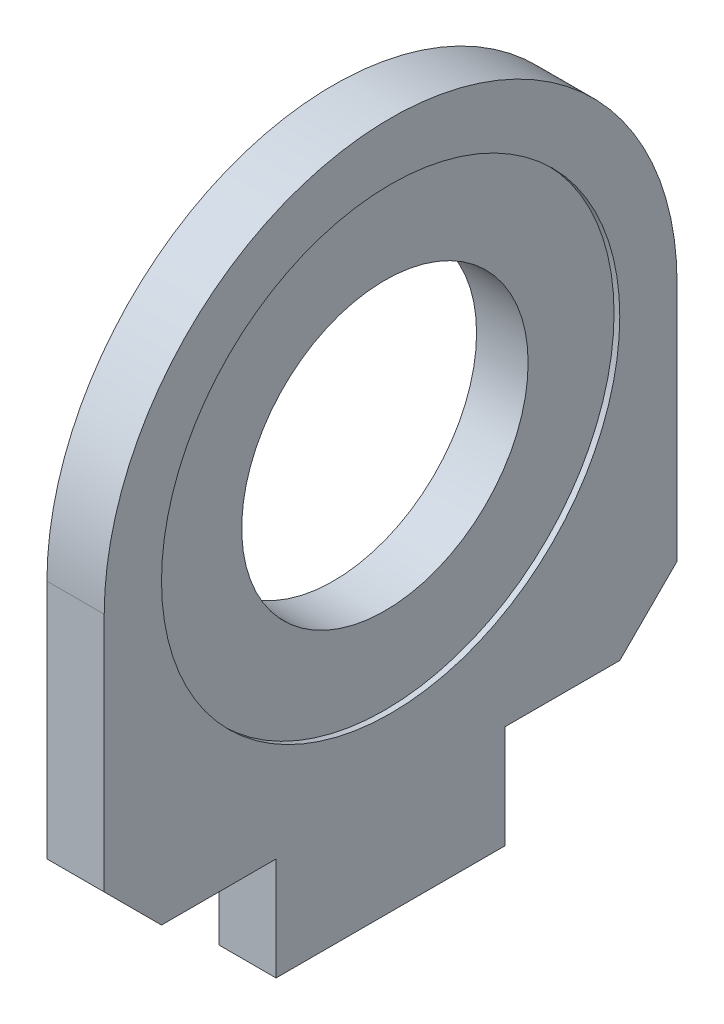
ISO-10303-21;
HEADER;
FILE_DESCRIPTION(('STEP AP214'),'2;1');
FILE_NAME('part.step','',(''),(''),'','','');
FILE_SCHEMA(('AUTOMOTIVE_DESIGN { 1 0 10303 214 1 1 1 1 }'));
ENDSEC;
DATA;
#1=APPLICATION_CONTEXT('core data for automotive mechanical design processes');
#2=APPLICATION_PROTOCOL_DEFINITION('international standard','automotive_design',2000,#1);
#3=PRODUCT_CONTEXT('',#1,'mechanical');
#4=PRODUCT('Part','Part','',(#3));
#5=PRODUCT_RELATED_PRODUCT_CATEGORY('part','',(#4));
#6=PRODUCT_DEFINITION_FORMATION('','',#4);
#7=PRODUCT_DEFINITION_CONTEXT('part definition',#1,'design');
#8=PRODUCT_DEFINITION('design','',#6,#7);
#9=PRODUCT_DEFINITION_SHAPE('','',#8);
#10=(LENGTH_UNIT() NAMED_UNIT(*) SI_UNIT(.MILLI.,.METRE.));
#11=(NAMED_UNIT(*) PLANE_ANGLE_UNIT() SI_UNIT($,.RADIAN.));
#12=(NAMED_UNIT(*) SI_UNIT($,.STERADIAN.) SOLID_ANGLE_UNIT());
#13=UNCERTAINTY_MEASURE_WITH_UNIT(LENGTH_MEASURE(1.E-05),#10,'distance_accuracy_value','');
#14=(GEOMETRIC_REPRESENTATION_CONTEXT(3) GLOBAL_UNCERTAINTY_ASSIGNED_CONTEXT((#13)) GLOBAL_UNIT_ASSIGNED_CONTEXT((#10,
#11,#12)) REPRESENTATION_CONTEXT('',''));
#15=CARTESIAN_POINT('',(0.,0.,0.));
#16=DIRECTION('',(0.,0.,1.));
#17=DIRECTION('',(1.,0.,0.));
#18=AXIS2_PLACEMENT_3D('',#15,#16,#17);
#19=CARTESIAN_POINT('',(-1.,70.,0.));
#20=DIRECTION('',(1.,0.,0.));
#21=DIRECTION('',(0.,0.,-1.));
#22=AXIS2_PLACEMENT_3D('',#19,#20,#21);
#23=CYLINDRICAL_SURFACE('',#22,40.);
#24=CARTESIAN_POINT('',(0.,70.,0.));
#25=DIRECTION('',(1.,0.,0.));
#26=DIRECTION('',(0.,0.,-1.));
#27=AXIS2_PLACEMENT_3D('',#24,#25,#26);
#28=CIRCLE('',#27,40.);
#29=CARTESIAN_POINT('',(0.,70.,-40.));
#30=VERTEX_POINT('',#29);
#31=EDGE_CURVE('E21',#30,#30,#28,.T.);
#32=ORIENTED_EDGE('',*,*,#31,.T.);
#33=EDGE_LOOP('',(#32));
#34=FACE_BOUND('',#33,.T.);
#35=CARTESIAN_POINT('',(-1.,70.,0.));
#36=DIRECTION('',(1.,0.,0.));
#37=DIRECTION('',(0.,0.,-1.));
#38=AXIS2_PLACEMENT_3D('',#35,#36,#37);
#39=CIRCLE('',#38,40.);
#40=CARTESIAN_POINT('',(-1.,70.,-40.));
#41=VERTEX_POINT('',#40);
#42=EDGE_CURVE('E174',#41,#41,#39,.T.);
#43=ORIENTED_EDGE('',*,*,#42,.F.);
#44=EDGE_LOOP('',(#43));
#45=FACE_BOUND('',#44,.T.);
#46=ADVANCED_FACE('F18',(#34,#45),#23,.F.);
#47=CARTESIAN_POINT('',(0.,70.,0.));
#48=DIRECTION('',(-1.,0.,0.));
#49=DIRECTION('',(0.,0.,1.));
#50=AXIS2_PLACEMENT_3D('',#47,#48,#49);
#51=PLANE('',#50);
#52=DIRECTION('',(0.,-0.707106781186549,-0.707106781186546));
#53=VECTOR('',#52,1.);
#54=CARTESIAN_POINT('',(0.,18.,40.));
#55=LINE('',#54,#53);
#56=CARTESIAN_POINT('',(0.,18.,40.));
#57=VERTEX_POINT('',#56);
#58=CARTESIAN_POINT('',(0.,28.,50.));
#59=VERTEX_POINT('',#58);
#60=EDGE_CURVE('E152',#57,#59,#55,.F.);
#61=ORIENTED_EDGE('',*,*,#60,.F.);
#62=DIRECTION('',(0.,0.,1.));
#63=VECTOR('',#62,1.);
#64=CARTESIAN_POINT('',(0.,18.,20.));
#65=LINE('',#64,#63);
#66=CARTESIAN_POINT('',(0.,18.,20.));
#67=VERTEX_POINT('',#66);
#68=EDGE_CURVE('E172',#57,#67,#65,.F.);
#69=ORIENTED_EDGE('',*,*,#68,.T.);
#70=DIRECTION('',(0.,1.,0.));
#71=VECTOR('',#70,1.);
#72=CARTESIAN_POINT('',(0.,18.,20.));
#73=LINE('',#72,#71);
#74=CARTESIAN_POINT('',(0.,0.,20.));
#75=VERTEX_POINT('',#74);
#76=EDGE_CURVE('E163',#67,#75,#73,.F.);
#77=ORIENTED_EDGE('',*,*,#76,.T.);
#78=DIRECTION('',(0.,0.,-1.));
#79=VECTOR('',#78,1.);
#80=CARTESIAN_POINT('',(0.,0.,50.));
#81=LINE('',#80,#79);
#82=CARTESIAN_POINT('',(0.,0.,-20.));
#83=VERTEX_POINT('',#82);
#84=EDGE_CURVE('E164',#83,#75,#81,.F.);
#85=ORIENTED_EDGE('',*,*,#84,.F.);
#86=DIRECTION('',(0.,-1.,0.));
#87=VECTOR('',#86,1.);
#88=CARTESIAN_POINT('',(0.,18.,-20.));
#89=LINE('',#88,#87);
#90=CARTESIAN_POINT('',(0.,18.,-20.));
#91=VERTEX_POINT('',#90);
#92=EDGE_CURVE('E124',#83,#91,#89,.F.);
#93=ORIENTED_EDGE('',*,*,#92,.T.);
#94=DIRECTION('',(0.,0.,1.));
#95=VECTOR('',#94,1.);
#96=CARTESIAN_POINT('',(0.,18.,-20.));
#97=LINE('',#96,#95);
#98=CARTESIAN_POINT('',(0.,18.,-40.));
#99=VERTEX_POINT('',#98);
#100=EDGE_CURVE('E133',#91,#99,#97,.F.);
#101=ORIENTED_EDGE('',*,*,#100,.T.);
#102=DIRECTION('',(0.,0.707106781186546,-0.707106781186549));
#103=VECTOR('',#102,1.);
#104=CARTESIAN_POINT('',(0.,28.,-50.));
#105=LINE('',#104,#103);
#106=CARTESIAN_POINT('',(0.,28.,-50.));
#107=VERTEX_POINT('',#106);
#108=EDGE_CURVE('E101',#107,#99,#105,.F.);
#109=ORIENTED_EDGE('',*,*,#108,.F.);
#110=DIRECTION('',(0.,1.,0.));
#111=VECTOR('',#110,1.);
#112=CARTESIAN_POINT('',(0.,0.,-50.));
#113=LINE('',#112,#111);
#114=CARTESIAN_POINT('',(0.,70.,-50.));
#115=VERTEX_POINT('',#114);
#116=EDGE_CURVE('E97',#115,#107,#113,.F.);
#117=ORIENTED_EDGE('',*,*,#116,.F.);
#118=CARTESIAN_POINT('',(0.,70.,0.));
#119=DIRECTION('',(1.,0.,0.));
#120=DIRECTION('',(0.,0.,-1.));
#121=AXIS2_PLACEMENT_3D('',#118,#119,#120);
#122=CIRCLE('',#121,50.);
#123=CARTESIAN_POINT('',(0.,70.,50.));
#124=VERTEX_POINT('',#123);
#125=EDGE_CURVE('E94',#124,#115,#122,.F.);
#126=ORIENTED_EDGE('',*,*,#125,.F.);
#127=DIRECTION('',(0.,1.,0.));
#128=VECTOR('',#127,1.);
#129=CARTESIAN_POINT('',(0.,0.,50.));
#130=LINE('',#129,#128);
#131=EDGE_CURVE('E113',#59,#124,#130,.T.);
#132=ORIENTED_EDGE('',*,*,#131,.F.);
#133=EDGE_LOOP('',(#61,#69,#77,#85,#93,#101,#109,#117,#126,#132));
#134=FACE_BOUND('',#133,.T.);
#135=ORIENTED_EDGE('',*,*,#31,.F.);
#136=EDGE_LOOP('',(#135));
#137=FACE_BOUND('',#136,.T.);
#138=ADVANCED_FACE('F98',(#134,#137),#51,.F.);
#139=CARTESIAN_POINT('',(-1.,70.,0.));
#140=DIRECTION('',(1.,0.,0.));
#141=DIRECTION('',(0.,0.,-1.));
#142=AXIS2_PLACEMENT_3D('',#139,#140,#141);
#143=PLANE('',#142);
#144=CARTESIAN_POINT('',(-0.999999999999999,70.,0.));
#145=DIRECTION('',(1.,0.,0.));
#146=DIRECTION('',(0.,0.,-1.));
#147=AXIS2_PLACEMENT_3D('',#144,#145,#146);
#148=CIRCLE('',#147,25.);
#149=CARTESIAN_POINT('',(-0.999999999999999,70.,-25.));
#150=VERTEX_POINT('',#149);
#151=EDGE_CURVE('E157',#150,#150,#148,.F.);
#152=ORIENTED_EDGE('',*,*,#151,.T.);
#153=EDGE_LOOP('',(#152));
#154=FACE_BOUND('',#153,.T.);
#155=ORIENTED_EDGE('',*,*,#42,.T.);
#156=EDGE_LOOP('',(#155));
#157=FACE_BOUND('',#156,.T.);
#158=ADVANCED_FACE('F208',(#154,#157),#143,.T.);
#159=CARTESIAN_POINT('',(0.,18.,20.));
#160=DIRECTION('',(0.,1.,0.));
#161=DIRECTION('',(0.,0.,1.));
#162=AXIS2_PLACEMENT_3D('',#159,#160,#161);
#163=PLANE('',#162);
#164=DIRECTION('',(1.,0.,0.));
#165=VECTOR('',#164,1.);
#166=CARTESIAN_POINT('',(0.,18.,40.));
#167=LINE('',#166,#165);
#168=CARTESIAN_POINT('',(-10.,18.,40.));
#169=VERTEX_POINT('',#168);
#170=EDGE_CURVE('E140',#169,#57,#167,.T.);
#171=ORIENTED_EDGE('',*,*,#170,.F.);
#172=DIRECTION('',(0.,0.,1.));
#173=VECTOR('',#172,1.);
#174=CARTESIAN_POINT('',(-10.,18.,0.));
#175=LINE('',#174,#173);
#176=CARTESIAN_POINT('',(-10.,18.,20.));
#177=VERTEX_POINT('',#176);
#178=EDGE_CURVE('E147',#177,#169,#175,.T.);
#179=ORIENTED_EDGE('',*,*,#178,.F.);
#180=DIRECTION('',(1.,0.,0.));
#181=VECTOR('',#180,1.);
#182=CARTESIAN_POINT('',(0.,18.,20.));
#183=LINE('',#182,#181);
#184=EDGE_CURVE('E160',#177,#67,#183,.T.);
#185=ORIENTED_EDGE('',*,*,#184,.T.);
#186=ORIENTED_EDGE('',*,*,#68,.F.);
#187=EDGE_LOOP('',(#171,#179,#185,#186));
#188=FACE_BOUND('',#187,.T.);
#189=ADVANCED_FACE('F214',(#188),#163,.F.);
#190=CARTESIAN_POINT('',(0.,18.,40.));
#191=DIRECTION('',(0.,-0.707106781186546,0.707106781186549));
#192=DIRECTION('',(0.,-0.707106781186549,-0.707106781186546));
#193=AXIS2_PLACEMENT_3D('',#190,#191,#192);
#194=PLANE('',#193);
#195=DIRECTION('',(0.,0.707106781186549,0.707106781186546));
#196=VECTOR('',#195,1.);
#197=CARTESIAN_POINT('',(-10.,18.,40.));
#198=LINE('',#197,#196);
#199=CARTESIAN_POINT('',(-10.,28.,50.));
#200=VERTEX_POINT('',#199);
#201=EDGE_CURVE('E143',#169,#200,#198,.T.);
#202=ORIENTED_EDGE('',*,*,#201,.F.);
#203=ORIENTED_EDGE('',*,*,#170,.T.);
#204=ORIENTED_EDGE('',*,*,#60,.T.);
#205=DIRECTION('',(1.,0.,0.));
#206=VECTOR('',#205,1.);
#207=CARTESIAN_POINT('',(-10.,28.,50.));
#208=LINE('',#207,#206);
#209=EDGE_CURVE('E137',#200,#59,#208,.T.);
#210=ORIENTED_EDGE('',*,*,#209,.F.);
#211=EDGE_LOOP('',(#202,#203,#204,#210));
#212=FACE_BOUND('',#211,.T.);
#213=ADVANCED_FACE('F255',(#212),#194,.T.);
#214=CARTESIAN_POINT('',(-10.,0.,50.));
#215=DIRECTION('',(0.,0.,1.));
#216=DIRECTION('',(1.,0.,0.));
#217=AXIS2_PLACEMENT_3D('',#214,#215,#216);
#218=PLANE('',#217);
#219=ORIENTED_EDGE('',*,*,#131,.T.);
#220=DIRECTION('',(1.,0.,0.));
#221=VECTOR('',#220,1.);
#222=CARTESIAN_POINT('',(-10.,70.,50.));
#223=LINE('',#222,#221);
#224=CARTESIAN_POINT('',(-10.,70.,50.));
#225=VERTEX_POINT('',#224);
#226=EDGE_CURVE('E106',#225,#124,#223,.T.);
#227=ORIENTED_EDGE('',*,*,#226,.F.);
#228=DIRECTION('',(0.,1.,0.));
#229=VECTOR('',#228,1.);
#230=CARTESIAN_POINT('',(-10.,70.,50.));
#231=LINE('',#230,#229);
#232=EDGE_CURVE('E146',#200,#225,#231,.T.);
#233=ORIENTED_EDGE('',*,*,#232,.F.);
#234=ORIENTED_EDGE('',*,*,#209,.T.);
#235=EDGE_LOOP('',(#219,#227,#233,#234));
#236=FACE_BOUND('',#235,.T.);
#237=ADVANCED_FACE('F252',(#236),#218,.T.);
#238=CARTESIAN_POINT('',(-10.,70.,0.));
#239=DIRECTION('',(1.,0.,0.));
#240=DIRECTION('',(0.,0.,-1.));
#241=AXIS2_PLACEMENT_3D('',#238,#239,#240);
#242=CYLINDRICAL_SURFACE('',#241,50.);
#243=CARTESIAN_POINT('',(-10.,70.,0.));
#244=DIRECTION('',(1.,0.,0.));
#245=DIRECTION('',(0.,0.,-1.));
#246=AXIS2_PLACEMENT_3D('',#243,#244,#245);
#247=CIRCLE('',#246,50.);
#248=CARTESIAN_POINT('',(-10.,70.,-50.));
#249=VERTEX_POINT('',#248);
#250=EDGE_CURVE('E197',#225,#249,#247,.F.);
#251=ORIENTED_EDGE('',*,*,#250,.F.);
#252=ORIENTED_EDGE('',*,*,#226,.T.);
#253=ORIENTED_EDGE('',*,*,#125,.T.);
#254=DIRECTION('',(-1.,0.,0.));
#255=VECTOR('',#254,1.);
#256=CARTESIAN_POINT('',(-10.,70.,-50.));
#257=LINE('',#256,#255);
#258=EDGE_CURVE('E105',#249,#115,#257,.F.);
#259=ORIENTED_EDGE('',*,*,#258,.F.);
#260=EDGE_LOOP('',(#251,#252,#253,#259));
#261=FACE_BOUND('',#260,.T.);
#262=ADVANCED_FACE('F111',(#261),#242,.T.);
#263=CARTESIAN_POINT('',(-10.,0.,-50.));
#264=DIRECTION('',(0.,0.,-1.));
#265=DIRECTION('',(-1.,0.,0.));
#266=AXIS2_PLACEMENT_3D('',#263,#264,#265);
#267=PLANE('',#266);
#268=DIRECTION('',(0.,1.,0.));
#269=VECTOR('',#268,1.);
#270=CARTESIAN_POINT('',(-10.,70.,-50.));
#271=LINE('',#270,#269);
#272=CARTESIAN_POINT('',(-10.,28.,-50.));
#273=VERTEX_POINT('',#272);
#274=EDGE_CURVE('E117',#249,#273,#271,.F.);
#275=ORIENTED_EDGE('',*,*,#274,.F.);
#276=ORIENTED_EDGE('',*,*,#258,.T.);
#277=ORIENTED_EDGE('',*,*,#116,.T.);
#278=DIRECTION('',(1.,0.,0.));
#279=VECTOR('',#278,1.);
#280=CARTESIAN_POINT('',(-10.,28.,-50.));
#281=LINE('',#280,#279);
#282=EDGE_CURVE('E120',#273,#107,#281,.T.);
#283=ORIENTED_EDGE('',*,*,#282,.F.);
#284=EDGE_LOOP('',(#275,#276,#277,#283));
#285=FACE_BOUND('',#284,.T.);
#286=ADVANCED_FACE('F115',(#285),#267,.T.);
#287=CARTESIAN_POINT('',(-10.,28.,-50.));
#288=DIRECTION('',(0.,-0.707106781186549,-0.707106781186546));
#289=DIRECTION('',(0.,0.707106781186546,-0.707106781186549));
#290=AXIS2_PLACEMENT_3D('',#287,#288,#289);
#291=PLANE('',#290);
#292=DIRECTION('',(0.,-0.707106781186546,0.707106781186549));
#293=VECTOR('',#292,1.);
#294=CARTESIAN_POINT('',(-10.,28.,-50.));
#295=LINE('',#294,#293);
#296=CARTESIAN_POINT('',(-10.,18.,-40.));
#297=VERTEX_POINT('',#296);
#298=EDGE_CURVE('E126',#273,#297,#295,.T.);
#299=ORIENTED_EDGE('',*,*,#298,.F.);
#300=ORIENTED_EDGE('',*,*,#282,.T.);
#301=ORIENTED_EDGE('',*,*,#108,.T.);
#302=DIRECTION('',(1.,0.,0.));
#303=VECTOR('',#302,1.);
#304=CARTESIAN_POINT('',(0.,18.,-40.));
#305=LINE('',#304,#303);
#306=EDGE_CURVE('E185',#99,#297,#305,.F.);
#307=ORIENTED_EDGE('',*,*,#306,.T.);
#308=EDGE_LOOP('',(#299,#300,#301,#307));
#309=FACE_BOUND('',#308,.T.);
#310=ADVANCED_FACE('F243',(#309),#291,.T.);
#311=CARTESIAN_POINT('',(0.,18.,-20.));
#312=DIRECTION('',(0.,1.,0.));
#313=DIRECTION('',(0.,0.,1.));
#314=AXIS2_PLACEMENT_3D('',#311,#312,#313);
#315=PLANE('',#314);
#316=ORIENTED_EDGE('',*,*,#306,.F.);
#317=ORIENTED_EDGE('',*,*,#100,.F.);
#318=DIRECTION('',(1.,0.,0.));
#319=VECTOR('',#318,1.);
#320=CARTESIAN_POINT('',(0.,18.,-20.));
#321=LINE('',#320,#319);
#322=CARTESIAN_POINT('',(-10.,18.,-20.));
#323=VERTEX_POINT('',#322);
#324=EDGE_CURVE('E276',#91,#323,#321,.F.);
#325=ORIENTED_EDGE('',*,*,#324,.T.);
#326=DIRECTION('',(0.,0.,1.));
#327=VECTOR('',#326,1.);
#328=CARTESIAN_POINT('',(-10.,18.,0.));
#329=LINE('',#328,#327);
#330=EDGE_CURVE('E129',#297,#323,#329,.T.);
#331=ORIENTED_EDGE('',*,*,#330,.F.);
#332=EDGE_LOOP('',(#316,#317,#325,#331));
#333=FACE_BOUND('',#332,.T.);
#334=ADVANCED_FACE('F239',(#333),#315,.F.);
#335=CARTESIAN_POINT('',(0.,18.,-20.));
#336=DIRECTION('',(0.,0.,1.));
#337=DIRECTION('',(0.,-1.,0.));
#338=AXIS2_PLACEMENT_3D('',#335,#336,#337);
#339=PLANE('',#338);
#340=ORIENTED_EDGE('',*,*,#324,.F.);
#341=ORIENTED_EDGE('',*,*,#92,.F.);
#342=DIRECTION('',(1.,0.,0.));
#343=VECTOR('',#342,1.);
#344=CARTESIAN_POINT('',(-10.,0.,-20.));
#345=LINE('',#344,#343);
#346=CARTESIAN_POINT('',(-10.,0.,-20.));
#347=VERTEX_POINT('',#346);
#348=EDGE_CURVE('E274',#347,#83,#345,.T.);
#349=ORIENTED_EDGE('',*,*,#348,.F.);
#350=DIRECTION('',(0.,1.,0.));
#351=VECTOR('',#350,1.);
#352=CARTESIAN_POINT('',(-10.,70.,-20.));
#353=LINE('',#352,#351);
#354=EDGE_CURVE('E285',#323,#347,#353,.F.);
#355=ORIENTED_EDGE('',*,*,#354,.F.);
#356=EDGE_LOOP('',(#340,#341,#349,#355));
#357=FACE_BOUND('',#356,.T.);
#358=ADVANCED_FACE('F236',(#357),#339,.F.);
#359=CARTESIAN_POINT('',(-10.,0.,50.));
#360=DIRECTION('',(0.,-1.,0.));
#361=DIRECTION('',(0.,0.,-1.));
#362=AXIS2_PLACEMENT_3D('',#359,#360,#361);
#363=PLANE('',#362);
#364=DIRECTION('',(1.,0.,0.));
#365=VECTOR('',#364,1.);
#366=CARTESIAN_POINT('',(0.,0.,20.));
#367=LINE('',#366,#365);
#368=CARTESIAN_POINT('',(-10.,0.,20.));
#369=VERTEX_POINT('',#368);
#370=EDGE_CURVE('E36',#75,#369,#367,.F.);
#371=ORIENTED_EDGE('',*,*,#370,.T.);
#372=DIRECTION('',(0.,0.,1.));
#373=VECTOR('',#372,1.);
#374=CARTESIAN_POINT('',(-10.,0.,0.));
#375=LINE('',#374,#373);
#376=EDGE_CURVE('E169',#347,#369,#375,.T.);
#377=ORIENTED_EDGE('',*,*,#376,.F.);
#378=ORIENTED_EDGE('',*,*,#348,.T.);
#379=ORIENTED_EDGE('',*,*,#84,.T.);
#380=EDGE_LOOP('',(#371,#377,#378,#379));
#381=FACE_BOUND('',#380,.T.);
#382=ADVANCED_FACE('F232',(#381),#363,.T.);
#383=CARTESIAN_POINT('',(0.,18.,20.));
#384=DIRECTION('',(0.,0.,-1.));
#385=DIRECTION('',(0.,1.,0.));
#386=AXIS2_PLACEMENT_3D('',#383,#384,#385);
#387=PLANE('',#386);
#388=ORIENTED_EDGE('',*,*,#370,.F.);
#389=ORIENTED_EDGE('',*,*,#76,.F.);
#390=ORIENTED_EDGE('',*,*,#184,.F.);
#391=DIRECTION('',(0.,1.,0.));
#392=VECTOR('',#391,1.);
#393=CARTESIAN_POINT('',(-10.,70.,20.));
#394=LINE('',#393,#392);
#395=EDGE_CURVE('E27',#369,#177,#394,.T.);
#396=ORIENTED_EDGE('',*,*,#395,.F.);
#397=EDGE_LOOP('',(#388,#389,#390,#396));
#398=FACE_BOUND('',#397,.T.);
#399=ADVANCED_FACE('F225',(#398),#387,.F.);
#400=CARTESIAN_POINT('',(-10.,70.,0.));
#401=DIRECTION('',(1.,0.,0.));
#402=DIRECTION('',(0.,0.,-1.));
#403=AXIS2_PLACEMENT_3D('',#400,#401,#402);
#404=CYLINDRICAL_SURFACE('',#403,25.);
#405=ORIENTED_EDGE('',*,*,#151,.F.);
#406=EDGE_LOOP('',(#405));
#407=FACE_BOUND('',#406,.T.);
#408=CARTESIAN_POINT('',(-10.,70.,0.));
#409=DIRECTION('',(1.,0.,0.));
#410=DIRECTION('',(0.,0.,-1.));
#411=AXIS2_PLACEMENT_3D('',#408,#409,#410);
#412=CIRCLE('',#411,25.);
#413=CARTESIAN_POINT('',(-10.,70.,-25.));
#414=VERTEX_POINT('',#413);
#415=EDGE_CURVE('E11',#414,#414,#412,.T.);
#416=ORIENTED_EDGE('',*,*,#415,.F.);
#417=EDGE_LOOP('',(#416));
#418=FACE_BOUND('',#417,.T.);
#419=ADVANCED_FACE('F219',(#407,#418),#404,.F.);
#420=CARTESIAN_POINT('',(-10.,70.,0.));
#421=DIRECTION('',(-1.,0.,0.));
#422=DIRECTION('',(0.,0.,1.));
#423=AXIS2_PLACEMENT_3D('',#420,#421,#422);
#424=PLANE('',#423);
#425=ORIENTED_EDGE('',*,*,#415,.T.);
#426=EDGE_LOOP('',(#425));
#427=FACE_BOUND('',#426,.T.);
#428=ORIENTED_EDGE('',*,*,#376,.T.);
#429=ORIENTED_EDGE('',*,*,#395,.T.);
#430=ORIENTED_EDGE('',*,*,#178,.T.);
#431=ORIENTED_EDGE('',*,*,#201,.T.);
#432=ORIENTED_EDGE('',*,*,#232,.T.);
#433=ORIENTED_EDGE('',*,*,#250,.T.);
#434=ORIENTED_EDGE('',*,*,#274,.T.);
#435=ORIENTED_EDGE('',*,*,#298,.T.);
#436=ORIENTED_EDGE('',*,*,#330,.T.);
#437=ORIENTED_EDGE('',*,*,#354,.T.);
#438=EDGE_LOOP('',(#428,#429,#430,#431,#432,#433,#434,#435,#436,#437));
#439=FACE_BOUND('',#438,.T.);
#440=ADVANCED_FACE('F217',(#427,#439),#424,.T.);
#441=CLOSED_SHELL('',(#46,#138,#158,#189,#213,#237,#262,#286,#310,#334,#358,#382,#399,#419,#440));
#442=MANIFOLD_SOLID_BREP('B1',#441);
#443=ADVANCED_BREP_SHAPE_REPRESENTATION('',(#18,#442),#14);
#444=SHAPE_DEFINITION_REPRESENTATION(#9,#443);
ENDSEC;
END-ISO-10303-21;
